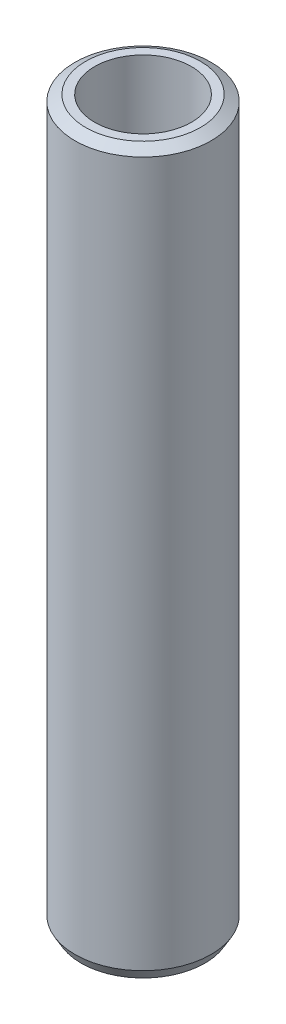
ISO-10303-21;
HEADER;
FILE_DESCRIPTION(('STEP AP214'),'2;1');
FILE_NAME('part.step','',(''),(''),'','','');
FILE_SCHEMA(('AUTOMOTIVE_DESIGN { 1 0 10303 214 1 1 1 1 }'));
ENDSEC;
DATA;
#1=APPLICATION_CONTEXT('core data for automotive mechanical design processes');
#2=APPLICATION_PROTOCOL_DEFINITION('international standard','automotive_design',2000,#1);
#3=PRODUCT_CONTEXT('',#1,'mechanical');
#4=PRODUCT('Part','Part','',(#3));
#5=PRODUCT_RELATED_PRODUCT_CATEGORY('part','',(#4));
#6=PRODUCT_DEFINITION_FORMATION('','',#4);
#7=PRODUCT_DEFINITION_CONTEXT('part definition',#1,'design');
#8=PRODUCT_DEFINITION('design','',#6,#7);
#9=PRODUCT_DEFINITION_SHAPE('','',#8);
#10=(LENGTH_UNIT() NAMED_UNIT(*) SI_UNIT(.MILLI.,.METRE.));
#11=(NAMED_UNIT(*) PLANE_ANGLE_UNIT() SI_UNIT($,.RADIAN.));
#12=(NAMED_UNIT(*) SI_UNIT($,.STERADIAN.) SOLID_ANGLE_UNIT());
#13=UNCERTAINTY_MEASURE_WITH_UNIT(LENGTH_MEASURE(1.E-05),#10,'distance_accuracy_value','');
#14=(GEOMETRIC_REPRESENTATION_CONTEXT(3) GLOBAL_UNCERTAINTY_ASSIGNED_CONTEXT((#13)) GLOBAL_UNIT_ASSIGNED_CONTEXT((#10,
#11,#12)) REPRESENTATION_CONTEXT('',''));
#15=CARTESIAN_POINT('',(0.,0.,0.));
#16=DIRECTION('',(0.,0.,1.));
#17=DIRECTION('',(1.,0.,0.));
#18=AXIS2_PLACEMENT_3D('',#15,#16,#17);
#19=CARTESIAN_POINT('',(0.,238.473349988166,0.));
#20=DIRECTION('',(0.,-1.,0.));
#21=DIRECTION('',(0.,0.,-1.));
#22=AXIS2_PLACEMENT_3D('',#19,#20,#21);
#23=CYLINDRICAL_SURFACE('',#22,22.5);
#24=CARTESIAN_POINT('',(0.,236.437249407728,0.));
#25=DIRECTION('',(0.,1.,0.));
#26=DIRECTION('',(0.,0.,1.));
#27=AXIS2_PLACEMENT_3D('',#24,#25,#26);
#28=CIRCLE('',#27,22.5);
#29=CARTESIAN_POINT('',(0.,236.437249407728,-22.5));
#30=VERTEX_POINT('',#29);
#31=EDGE_CURVE('E50',#30,#30,#28,.F.);
#32=ORIENTED_EDGE('',*,*,#31,.T.);
#33=EDGE_LOOP('',(#32));
#34=FACE_BOUND('',#33,.T.);
#35=CARTESIAN_POINT('',(0.,3.5266296546384,0.));
#36=DIRECTION('',(0.,1.,0.));
#37=DIRECTION('',(0.,0.,1.));
#38=AXIS2_PLACEMENT_3D('',#35,#36,#37);
#39=CIRCLE('',#38,22.5);
#40=CARTESIAN_POINT('',(0.,3.5266296546384,22.5));
#41=VERTEX_POINT('',#40);
#42=EDGE_CURVE('E51',#41,#41,#39,.T.);
#43=ORIENTED_EDGE('',*,*,#42,.T.);
#44=EDGE_LOOP('',(#43));
#45=FACE_BOUND('',#44,.T.);
#46=ADVANCED_FACE('F39',(#34,#45),#23,.T.);
#47=CARTESIAN_POINT('',(0.,238.473349988166,0.));
#48=DIRECTION('',(0.,1.,0.));
#49=DIRECTION('',(0.,0.,1.));
#50=AXIS2_PLACEMENT_3D('',#47,#48,#49);
#51=PLANE('',#50);
#52=CARTESIAN_POINT('',(0.,238.473349988166,0.));
#53=DIRECTION('',(0.,1.,0.));
#54=DIRECTION('',(0.,0.,1.));
#55=AXIS2_PLACEMENT_3D('',#52,#53,#54);
#56=CIRCLE('',#55,18.9733703453616);
#57=CARTESIAN_POINT('',(0.,238.473349988166,-18.9733703453616));
#58=VERTEX_POINT('',#57);
#59=EDGE_CURVE('E54',#58,#58,#56,.T.);
#60=ORIENTED_EDGE('',*,*,#59,.T.);
#61=EDGE_LOOP('',(#60));
#62=FACE_BOUND('',#61,.T.);
#63=CARTESIAN_POINT('',(0.,238.473349988166,0.));
#64=DIRECTION('',(0.,1.,0.));
#65=DIRECTION('',(0.,0.,1.));
#66=AXIS2_PLACEMENT_3D('',#63,#64,#65);
#67=CIRCLE('',#66,15.9919851443431);
#68=CARTESIAN_POINT('',(0.,238.473349988166,15.9919851443431));
#69=VERTEX_POINT('',#68);
#70=EDGE_CURVE('E58',#69,#69,#67,.T.);
#71=ORIENTED_EDGE('',*,*,#70,.F.);
#72=EDGE_LOOP('',(#71));
#73=FACE_BOUND('',#72,.T.);
#74=ADVANCED_FACE('F69',(#62,#73),#51,.T.);
#75=CARTESIAN_POINT('',(0.,0.,0.));
#76=DIRECTION('',(0.,1.,0.));
#77=DIRECTION('',(0.,0.,1.));
#78=AXIS2_PLACEMENT_3D('',#75,#76,#77);
#79=PLANE('',#78);
#80=CARTESIAN_POINT('',(0.,0.,0.));
#81=DIRECTION('',(0.,1.,0.));
#82=DIRECTION('',(0.,0.,1.));
#83=AXIS2_PLACEMENT_3D('',#80,#81,#82);
#84=CIRCLE('',#83,20.4638994195624);
#85=CARTESIAN_POINT('',(0.,0.,20.4638994195624));
#86=VERTEX_POINT('',#85);
#87=EDGE_CURVE('E10',#86,#86,#84,.F.);
#88=ORIENTED_EDGE('',*,*,#87,.T.);
#89=EDGE_LOOP('',(#88));
#90=FACE_BOUND('',#89,.T.);
#91=CARTESIAN_POINT('',(0.,0.,0.));
#92=DIRECTION('',(0.,1.,0.));
#93=DIRECTION('',(0.,0.,1.));
#94=AXIS2_PLACEMENT_3D('',#91,#92,#93);
#95=CIRCLE('',#94,15.9919851443431);
#96=CARTESIAN_POINT('',(0.,0.,15.9919851443431));
#97=VERTEX_POINT('',#96);
#98=EDGE_CURVE('E63',#97,#97,#95,.T.);
#99=ORIENTED_EDGE('',*,*,#98,.T.);
#100=EDGE_LOOP('',(#99));
#101=FACE_BOUND('',#100,.T.);
#102=ADVANCED_FACE('F75',(#90,#101),#79,.F.);
#103=CARTESIAN_POINT('',(0.,238.473349988166,0.));
#104=DIRECTION('',(0.,-1.,0.));
#105=DIRECTION('',(0.,0.,-1.));
#106=AXIS2_PLACEMENT_3D('',#103,#104,#105);
#107=CYLINDRICAL_SURFACE('',#106,15.9919851443431);
#108=ORIENTED_EDGE('',*,*,#70,.T.);
#109=EDGE_LOOP('',(#108));
#110=FACE_BOUND('',#109,.T.);
#111=ORIENTED_EDGE('',*,*,#98,.F.);
#112=EDGE_LOOP('',(#111));
#113=FACE_BOUND('',#112,.T.);
#114=ADVANCED_FACE('F70',(#110,#113),#107,.F.);
#115=CARTESIAN_POINT('',(0.,238.473349988166,0.));
#116=DIRECTION('',(0.,-1.,0.));
#117=DIRECTION('',(0.,0.,-1.));
#118=AXIS2_PLACEMENT_3D('',#115,#116,#117);
#119=CONICAL_SURFACE('',#118,18.9733703453616,1.0471975511966);
#120=CARTESIAN_POINT('',(0.,236.437249407728,-22.5));
#121=CARTESIAN_POINT('',(0.,236.458458788774,-22.4632642744309));
#122=CARTESIAN_POINT('',(0.,236.479668169821,-22.4265285488617));
#123=CARTESIAN_POINT('',(0.,236.522086931913,-22.3530570977234));
#124=CARTESIAN_POINT('',(0.,236.543296312959,-22.3163213721543));
#125=CARTESIAN_POINT('',(0.,236.585715075052,-22.242849921016));
#126=CARTESIAN_POINT('',(0.,236.606924456098,-22.2061141954468));
#127=CARTESIAN_POINT('',(0.,236.64934321819,-22.1326427443085));
#128=CARTESIAN_POINT('',(0.,236.670552599237,-22.0959070187394));
#129=CARTESIAN_POINT('',(0.,236.712971361329,-22.0224355676011));
#130=CARTESIAN_POINT('',(0.,236.734180742375,-21.9856998420319));
#131=CARTESIAN_POINT('',(0.,236.776599504468,-21.9122283908936));
#132=CARTESIAN_POINT('',(0.,236.797808885514,-21.8754926653245));
#133=CARTESIAN_POINT('',(0.,236.840227647606,-21.8020212141862));
#134=CARTESIAN_POINT('',(0.,236.861437028653,-21.765285488617));
#135=CARTESIAN_POINT('',(0.,236.903855790745,-21.6918140374787));
#136=CARTESIAN_POINT('',(0.,236.925065171791,-21.6550783119096));
#137=CARTESIAN_POINT('',(0.,236.967483933884,-21.5816068607713));
#138=CARTESIAN_POINT('',(0.,236.98869331493,-21.5448711352021));
#139=CARTESIAN_POINT('',(0.,237.031112077022,-21.4713996840638));
#140=CARTESIAN_POINT('',(0.,237.052321458069,-21.4346639584947));
#141=CARTESIAN_POINT('',(0.,237.094740220161,-21.3611925073564));
#142=CARTESIAN_POINT('',(0.,237.115949601207,-21.3244567817872));
#143=CARTESIAN_POINT('',(0.,237.1583683633,-21.2509853306489));
#144=CARTESIAN_POINT('',(0.,237.179577744346,-21.2142496050798));
#145=CARTESIAN_POINT('',(0.,237.221996506439,-21.1407781539415));
#146=CARTESIAN_POINT('',(0.,237.243205887485,-21.1040424283723));
#147=CARTESIAN_POINT('',(0.,237.285624649577,-21.030570977234));
#148=CARTESIAN_POINT('',(0.,237.306834030623,-20.9938352516649));
#149=CARTESIAN_POINT('',(0.,237.349252792716,-20.9203638005266));
#150=CARTESIAN_POINT('',(0.,237.370462173762,-20.8836280749574));
#151=CARTESIAN_POINT('',(0.,237.412880935855,-20.8101566238191));
#152=CARTESIAN_POINT('',(0.,237.434090316901,-20.77342089825));
#153=CARTESIAN_POINT('',(0.,237.476509078993,-20.6999494471117));
#154=CARTESIAN_POINT('',(0.,237.497718460039,-20.6632137215425));
#155=CARTESIAN_POINT('',(0.,237.540137222132,-20.5897422704042));
#156=CARTESIAN_POINT('',(0.,237.561346603178,-20.5530065448351));
#157=CARTESIAN_POINT('',(0.,237.603765365271,-20.4795350936968));
#158=CARTESIAN_POINT('',(0.,237.624974746317,-20.4427993681276));
#159=CARTESIAN_POINT('',(0.,237.667393508409,-20.3693279169893));
#160=CARTESIAN_POINT('',(0.,237.688602889455,-20.3325921914202));
#161=CARTESIAN_POINT('',(0.,237.731021651548,-20.2591207402819));
#162=CARTESIAN_POINT('',(0.,237.752231032594,-20.2223850147127));
#163=CARTESIAN_POINT('',(0.,237.794649794687,-20.1489135635744));
#164=CARTESIAN_POINT('',(0.,237.815859175733,-20.1121778380052));
#165=CARTESIAN_POINT('',(0.,237.858277937825,-20.0387063868669));
#166=CARTESIAN_POINT('',(0.,237.879487318872,-20.0019706612978));
#167=CARTESIAN_POINT('',(0.,237.921906080964,-19.9284992101595));
#168=CARTESIAN_POINT('',(0.,237.94311546201,-19.8917634845903));
#169=CARTESIAN_POINT('',(0.,237.985534224103,-19.818292033452));
#170=CARTESIAN_POINT('',(0.,238.006743605149,-19.7815563078829));
#171=CARTESIAN_POINT('',(0.,238.049162367241,-19.7080848567446));
#172=CARTESIAN_POINT('',(0.,238.070371748288,-19.6713491311754));
#173=CARTESIAN_POINT('',(0.,238.11279051038,-19.5978776800371));
#174=CARTESIAN_POINT('',(0.,238.133999891426,-19.561141954468));
#175=CARTESIAN_POINT('',(0.,238.176418653519,-19.4876705033297));
#176=CARTESIAN_POINT('',(0.,238.197628034565,-19.4509347777605));
#177=CARTESIAN_POINT('',(0.,238.240046796657,-19.3774633266222));
#178=CARTESIAN_POINT('',(0.,238.261256177704,-19.3407276010531));
#179=CARTESIAN_POINT('',(0.,238.303674939796,-19.2672561499148));
#180=CARTESIAN_POINT('',(0.,238.324884320842,-19.2305204243456));
#181=CARTESIAN_POINT('',(0.,238.367303082935,-19.1570489732073));
#182=CARTESIAN_POINT('',(0.,238.388512463981,-19.1203132476382));
#183=CARTESIAN_POINT('',(0.,238.430931226073,-19.0468417964999));
#184=CARTESIAN_POINT('',(0.,238.45214060712,-19.0101060709307));
#185=CARTESIAN_POINT('',(0.,238.473349988166,-18.9733703453616));
#186=B_SPLINE_CURVE_WITH_KNOTS('',3,(#120,#121,#122,#123,#124,#125,#126,#127,#128,#129,#130,
#131,#132,#133,#134,#135,#136,#137,#138,#139,#140,#141,#142,#143,#144,#145,#146,#147,#148,#149,
#150,#151,#152,#153,#154,#155,#156,#157,#158,#159,#160,#161,#162,#163,#164,#165,#166,#167,#168,
#169,#170,#171,#172,#173,#174,#175,#176,#177,#178,#179,#180,#181,#182,#183,#184,#185),
.UNSPECIFIED.,.F.,.F.,(4,2,2,2,2,2,2,2,2,2,2,2,2,2,2,2,2,2,2,2,2,2,2,2,2,2,2,2,2,2,2,2,4),(0.,
0.127256286277353,0.254512572554702,0.381768858832055,0.509025145109408,0.636281431386761,
0.763537717664113,0.890794003941466,1.01805029021882,1.14530657649617,1.27256286277352,
1.39981914905087,1.52707543532823,1.65433172160558,1.78158800788293,1.90884429416029,
2.03610058043762,2.16335686671497,2.29061315299233,2.41786943926968,2.54512572554703,
2.67238201182438,2.79963829810174,2.92689458437909,3.05415087065644,3.18140715693379,
3.30866344321114,3.4359197294885,3.56317601576585,3.6904323020432,3.81768858832055,
3.9449448745979,4.07220116087526),.UNSPECIFIED.);
#187=EDGE_CURVE('BSEAM81',#30,#58,#186,.T.);
#188=ORIENTED_EDGE('',*,*,#31,.F.);
#189=ORIENTED_EDGE('',*,*,#59,.F.);
#190=ORIENTED_EDGE('',*,*,#187,.T.);
#191=ORIENTED_EDGE('',*,*,#187,.F.);
#192=EDGE_LOOP('',(#188,#190,#189,#191));
#193=FACE_BOUND('',#192,.T.);
#194=ADVANCED_FACE('F81',(#193),#119,.T.);
#195=CARTESIAN_POINT('',(0.,3.5266296546384,0.));
#196=DIRECTION('',(0.,1.,0.));
#197=DIRECTION('',(0.,0.,1.));
#198=AXIS2_PLACEMENT_3D('',#195,#196,#197);
#199=CONICAL_SURFACE('',#198,22.5,0.523598775598307);
#200=ORIENTED_EDGE('',*,*,#87,.F.);
#201=EDGE_LOOP('',(#200));
#202=FACE_BOUND('',#201,.T.);
#203=ORIENTED_EDGE('',*,*,#42,.F.);
#204=EDGE_LOOP('',(#203));
#205=FACE_BOUND('',#204,.T.);
#206=ADVANCED_FACE('F45',(#202,#205),#199,.T.);
#207=CLOSED_SHELL('',(#46,#74,#102,#114,#194,#206));
#208=MANIFOLD_SOLID_BREP('B2',#207);
#209=ADVANCED_BREP_SHAPE_REPRESENTATION('',(#18,#208),#14);
#210=SHAPE_DEFINITION_REPRESENTATION(#9,#209);
ENDSEC;
END-ISO-10303-21;
